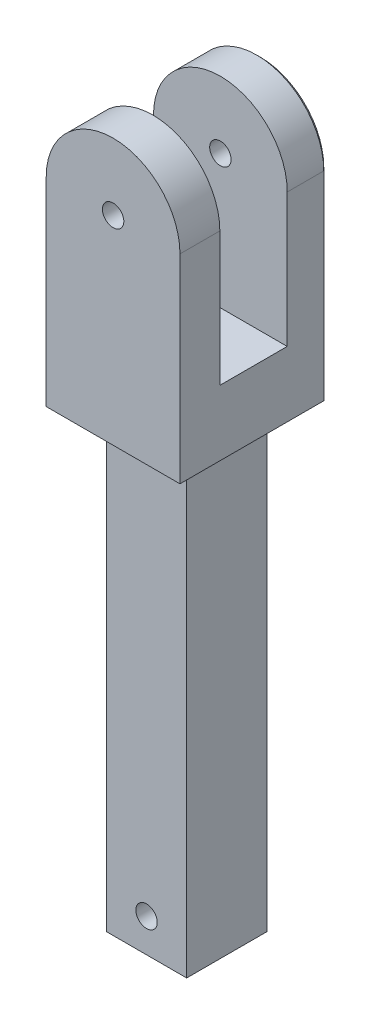
ISO-10303-21;
HEADER;
FILE_DESCRIPTION(('STEP AP214'),'2;1');
FILE_NAME('part.step','',(''),(''),'','','');
FILE_SCHEMA(('AUTOMOTIVE_DESIGN { 1 0 10303 214 1 1 1 1 }'));
ENDSEC;
DATA;
#1=APPLICATION_CONTEXT('core data for automotive mechanical design processes');
#2=APPLICATION_PROTOCOL_DEFINITION('international standard','automotive_design',2000,#1);
#3=PRODUCT_CONTEXT('',#1,'mechanical');
#4=PRODUCT('Part','Part','',(#3));
#5=PRODUCT_RELATED_PRODUCT_CATEGORY('part','',(#4));
#6=PRODUCT_DEFINITION_FORMATION('','',#4);
#7=PRODUCT_DEFINITION_CONTEXT('part definition',#1,'design');
#8=PRODUCT_DEFINITION('design','',#6,#7);
#9=PRODUCT_DEFINITION_SHAPE('','',#8);
#10=(LENGTH_UNIT() NAMED_UNIT(*) SI_UNIT(.MILLI.,.METRE.));
#11=(NAMED_UNIT(*) PLANE_ANGLE_UNIT() SI_UNIT($,.RADIAN.));
#12=(NAMED_UNIT(*) SI_UNIT($,.STERADIAN.) SOLID_ANGLE_UNIT());
#13=UNCERTAINTY_MEASURE_WITH_UNIT(LENGTH_MEASURE(1.E-05),#10,'distance_accuracy_value','');
#14=(GEOMETRIC_REPRESENTATION_CONTEXT(3) GLOBAL_UNCERTAINTY_ASSIGNED_CONTEXT((#13)) GLOBAL_UNIT_ASSIGNED_CONTEXT((#10,
#11,#12)) REPRESENTATION_CONTEXT('',''));
#15=CARTESIAN_POINT('',(0.,0.,0.));
#16=DIRECTION('',(0.,0.,1.));
#17=DIRECTION('',(1.,0.,0.));
#18=AXIS2_PLACEMENT_3D('',#15,#16,#17);
#19=CARTESIAN_POINT('',(10.,0.,12.));
#20=DIRECTION('',(-1.,0.,0.));
#21=DIRECTION('',(0.,-1.,0.));
#22=AXIS2_PLACEMENT_3D('',#19,#20,#21);
#23=PLANE('',#22);
#24=DIRECTION('',(0.,0.,-1.));
#25=VECTOR('',#24,1.);
#26=CARTESIAN_POINT('',(10.,-29.7764175480678,12.));
#27=LINE('',#26,#25);
#28=CARTESIAN_POINT('',(10.,-29.7764175480678,17.));
#29=VERTEX_POINT('',#28);
#30=CARTESIAN_POINT('',(10.,-29.7764175480678,-4.5));
#31=VERTEX_POINT('',#30);
#32=EDGE_CURVE('E58',#29,#31,#27,.T.);
#33=ORIENTED_EDGE('',*,*,#32,.T.);
#34=DIRECTION('',(0.,1.,0.));
#35=VECTOR('',#34,1.);
#36=CARTESIAN_POINT('',(10.,0.,-4.5));
#37=LINE('',#36,#35);
#38=CARTESIAN_POINT('',(10.,0.,-4.5));
#39=VERTEX_POINT('',#38);
#40=EDGE_CURVE('E50',#31,#39,#37,.T.);
#41=ORIENTED_EDGE('',*,*,#40,.T.);
#42=DIRECTION('',(0.,0.,-1.));
#43=VECTOR('',#42,1.);
#44=CARTESIAN_POINT('',(10.,0.,12.));
#45=LINE('',#44,#43);
#46=CARTESIAN_POINT('',(10.,0.,0.959999999999997));
#47=VERTEX_POINT('',#46);
#48=EDGE_CURVE('E244',#47,#39,#45,.T.);
#49=ORIENTED_EDGE('',*,*,#48,.F.);
#50=DIRECTION('',(0.,1.,0.));
#51=VECTOR('',#50,1.);
#52=CARTESIAN_POINT('',(10.,0.,0.959999999999997));
#53=LINE('',#52,#51);
#54=CARTESIAN_POINT('',(10.,-20.,0.959999999999997));
#55=VERTEX_POINT('',#54);
#56=EDGE_CURVE('E201',#55,#47,#53,.T.);
#57=ORIENTED_EDGE('',*,*,#56,.F.);
#58=DIRECTION('',(0.,0.,-1.));
#59=VECTOR('',#58,1.);
#60=CARTESIAN_POINT('',(10.,-20.,0.));
#61=LINE('',#60,#59);
#62=CARTESIAN_POINT('',(10.,-20.,11.04));
#63=VERTEX_POINT('',#62);
#64=EDGE_CURVE('E236',#63,#55,#61,.T.);
#65=ORIENTED_EDGE('',*,*,#64,.F.);
#66=DIRECTION('',(0.,1.,0.));
#67=VECTOR('',#66,1.);
#68=CARTESIAN_POINT('',(10.,0.,11.04));
#69=LINE('',#68,#67);
#70=CARTESIAN_POINT('',(10.,0.,11.04));
#71=VERTEX_POINT('',#70);
#72=EDGE_CURVE('E203',#63,#71,#69,.T.);
#73=ORIENTED_EDGE('',*,*,#72,.T.);
#74=CARTESIAN_POINT('',(10.,0.,17.));
#75=VERTEX_POINT('',#74);
#76=EDGE_CURVE('E245',#75,#71,#45,.T.);
#77=ORIENTED_EDGE('',*,*,#76,.F.);
#78=DIRECTION('',(0.,1.,0.));
#79=VECTOR('',#78,1.);
#80=CARTESIAN_POINT('',(10.,0.,17.));
#81=LINE('',#80,#79);
#82=EDGE_CURVE('E234',#29,#75,#81,.T.);
#83=ORIENTED_EDGE('',*,*,#82,.F.);
#84=EDGE_LOOP('',(#33,#41,#49,#57,#65,#73,#77,#83));
#85=FACE_BOUND('',#84,.T.);
#86=ADVANCED_FACE('F40',(#85),#23,.F.);
#87=CARTESIAN_POINT('',(0.,0.,12.));
#88=DIRECTION('',(0.,0.,-1.));
#89=DIRECTION('',(-1.,0.,0.));
#90=AXIS2_PLACEMENT_3D('',#87,#88,#89);
#91=CYLINDRICAL_SURFACE('',#90,10.);
#92=ORIENTED_EDGE('',*,*,#48,.T.);
#93=CARTESIAN_POINT('',(0.,0.,-4.5));
#94=DIRECTION('',(0.,0.,-1.));
#95=DIRECTION('',(-1.,0.,0.));
#96=AXIS2_PLACEMENT_3D('',#93,#94,#95);
#97=CIRCLE('',#96,10.);
#98=CARTESIAN_POINT('',(-10.,0.,-4.5));
#99=VERTEX_POINT('',#98);
#100=EDGE_CURVE('E277',#39,#99,#97,.F.);
#101=ORIENTED_EDGE('',*,*,#100,.T.);
#102=DIRECTION('',(0.,0.,-1.));
#103=VECTOR('',#102,1.);
#104=CARTESIAN_POINT('',(-10.,0.,12.));
#105=LINE('',#104,#103);
#106=CARTESIAN_POINT('',(-10.,0.,0.959999999999997));
#107=VERTEX_POINT('',#106);
#108=EDGE_CURVE('E239',#107,#99,#105,.T.);
#109=ORIENTED_EDGE('',*,*,#108,.F.);
#110=CARTESIAN_POINT('',(0.,0.,0.959999999999997));
#111=DIRECTION('',(0.,0.,1.));
#112=DIRECTION('',(1.,0.,0.));
#113=AXIS2_PLACEMENT_3D('',#110,#111,#112);
#114=CIRCLE('',#113,10.);
#115=EDGE_CURVE('E221',#47,#107,#114,.T.);
#116=ORIENTED_EDGE('',*,*,#115,.F.);
#117=EDGE_LOOP('',(#92,#101,#109,#116));
#118=FACE_BOUND('',#117,.T.);
#119=ADVANCED_FACE('F329',(#118),#91,.T.);
#120=CARTESIAN_POINT('',(-10.,0.,12.));
#121=DIRECTION('',(1.,0.,0.));
#122=DIRECTION('',(0.,1.,0.));
#123=AXIS2_PLACEMENT_3D('',#120,#121,#122);
#124=PLANE('',#123);
#125=ORIENTED_EDGE('',*,*,#108,.T.);
#126=DIRECTION('',(0.,-1.,0.));
#127=VECTOR('',#126,1.);
#128=CARTESIAN_POINT('',(-10.,-30.2764175480678,-4.5));
#129=LINE('',#128,#127);
#130=CARTESIAN_POINT('',(-10.,-29.7764175480678,-4.5));
#131=VERTEX_POINT('',#130);
#132=EDGE_CURVE('E265',#99,#131,#129,.T.);
#133=ORIENTED_EDGE('',*,*,#132,.T.);
#134=DIRECTION('',(0.,0.,1.));
#135=VECTOR('',#134,1.);
#136=CARTESIAN_POINT('',(-10.,-29.7764175480678,12.));
#137=LINE('',#136,#135);
#138=CARTESIAN_POINT('',(-10.,-29.7764175480678,17.));
#139=VERTEX_POINT('',#138);
#140=EDGE_CURVE('E263',#131,#139,#137,.T.);
#141=ORIENTED_EDGE('',*,*,#140,.T.);
#142=DIRECTION('',(0.,-1.,0.));
#143=VECTOR('',#142,1.);
#144=CARTESIAN_POINT('',(-10.,0.,17.));
#145=LINE('',#144,#143);
#146=CARTESIAN_POINT('',(-10.,0.,17.));
#147=VERTEX_POINT('',#146);
#148=EDGE_CURVE('E232',#147,#139,#145,.T.);
#149=ORIENTED_EDGE('',*,*,#148,.F.);
#150=CARTESIAN_POINT('',(-10.,0.,11.04));
#151=VERTEX_POINT('',#150);
#152=EDGE_CURVE('E241',#147,#151,#105,.T.);
#153=ORIENTED_EDGE('',*,*,#152,.T.);
#154=DIRECTION('',(0.,1.,0.));
#155=VECTOR('',#154,1.);
#156=CARTESIAN_POINT('',(-10.,0.,11.04));
#157=LINE('',#156,#155);
#158=CARTESIAN_POINT('',(-10.,-20.,11.04));
#159=VERTEX_POINT('',#158);
#160=EDGE_CURVE('E204',#159,#151,#157,.T.);
#161=ORIENTED_EDGE('',*,*,#160,.F.);
#162=DIRECTION('',(0.,0.,-1.));
#163=VECTOR('',#162,1.);
#164=CARTESIAN_POINT('',(-10.,-20.,0.));
#165=LINE('',#164,#163);
#166=CARTESIAN_POINT('',(-10.,-20.,0.959999999999997));
#167=VERTEX_POINT('',#166);
#168=EDGE_CURVE('E237',#159,#167,#165,.T.);
#169=ORIENTED_EDGE('',*,*,#168,.T.);
#170=DIRECTION('',(0.,1.,0.));
#171=VECTOR('',#170,1.);
#172=CARTESIAN_POINT('',(-10.,0.,0.959999999999997));
#173=LINE('',#172,#171);
#174=EDGE_CURVE('E166',#167,#107,#173,.T.);
#175=ORIENTED_EDGE('',*,*,#174,.T.);
#176=EDGE_LOOP('',(#125,#133,#141,#149,#153,#161,#169,#175));
#177=FACE_BOUND('',#176,.T.);
#178=ADVANCED_FACE('F334',(#177),#124,.F.);
#179=CARTESIAN_POINT('',(0.,0.,12.));
#180=DIRECTION('',(0.,0.,-1.));
#181=DIRECTION('',(-1.,0.,0.));
#182=AXIS2_PLACEMENT_3D('',#179,#180,#181);
#183=CYLINDRICAL_SURFACE('',#182,1.6);
#184=CARTESIAN_POINT('',(0.,0.,-5.));
#185=DIRECTION('',(0.,0.,-1.));
#186=DIRECTION('',(-1.,0.,0.));
#187=AXIS2_PLACEMENT_3D('',#184,#185,#186);
#188=CIRCLE('',#187,1.6);
#189=CARTESIAN_POINT('',(-1.6,0.,-5.));
#190=VERTEX_POINT('',#189);
#191=EDGE_CURVE('E223',#190,#190,#188,.F.);
#192=ORIENTED_EDGE('',*,*,#191,.F.);
#193=EDGE_LOOP('',(#192));
#194=FACE_BOUND('',#193,.T.);
#195=CARTESIAN_POINT('',(0.,0.,0.959999999999997));
#196=DIRECTION('',(0.,0.,1.));
#197=DIRECTION('',(1.,0.,0.));
#198=AXIS2_PLACEMENT_3D('',#195,#196,#197);
#199=CIRCLE('',#198,1.6);
#200=CARTESIAN_POINT('',(1.6,0.,0.959999999999997));
#201=VERTEX_POINT('',#200);
#202=EDGE_CURVE('E220',#201,#201,#199,.T.);
#203=ORIENTED_EDGE('',*,*,#202,.T.);
#204=EDGE_LOOP('',(#203));
#205=FACE_BOUND('',#204,.T.);
#206=ADVANCED_FACE('F345',(#194,#205),#183,.F.);
#207=ORIENTED_EDGE('',*,*,#76,.T.);
#208=CARTESIAN_POINT('',(0.,0.,11.04));
#209=DIRECTION('',(0.,0.,1.));
#210=DIRECTION('',(1.,0.,0.));
#211=AXIS2_PLACEMENT_3D('',#208,#209,#210);
#212=CIRCLE('',#211,10.);
#213=EDGE_CURVE('E218',#71,#151,#212,.T.);
#214=ORIENTED_EDGE('',*,*,#213,.T.);
#215=ORIENTED_EDGE('',*,*,#152,.F.);
#216=CARTESIAN_POINT('',(0.,0.,17.));
#217=DIRECTION('',(0.,0.,1.));
#218=DIRECTION('',(1.,0.,0.));
#219=AXIS2_PLACEMENT_3D('',#216,#217,#218);
#220=CIRCLE('',#219,10.);
#221=EDGE_CURVE('E229',#75,#147,#220,.T.);
#222=ORIENTED_EDGE('',*,*,#221,.F.);
#223=EDGE_LOOP('',(#207,#214,#215,#222));
#224=FACE_BOUND('',#223,.T.);
#225=ADVANCED_FACE('F337',(#224),#91,.T.);
#226=CARTESIAN_POINT('',(0.,0.,11.04));
#227=DIRECTION('',(0.,0.,1.));
#228=DIRECTION('',(1.,0.,0.));
#229=AXIS2_PLACEMENT_3D('',#226,#227,#228);
#230=CIRCLE('',#229,1.6);
#231=CARTESIAN_POINT('',(1.6,0.,11.04));
#232=VERTEX_POINT('',#231);
#233=EDGE_CURVE('E215',#232,#232,#230,.T.);
#234=ORIENTED_EDGE('',*,*,#233,.F.);
#235=EDGE_LOOP('',(#234));
#236=FACE_BOUND('',#235,.T.);
#237=CARTESIAN_POINT('',(0.,0.,17.));
#238=DIRECTION('',(0.,0.,1.));
#239=DIRECTION('',(1.,0.,0.));
#240=AXIS2_PLACEMENT_3D('',#237,#238,#239);
#241=CIRCLE('',#240,1.6);
#242=CARTESIAN_POINT('',(1.6,0.,17.));
#243=VERTEX_POINT('',#242);
#244=EDGE_CURVE('E226',#243,#243,#241,.F.);
#245=ORIENTED_EDGE('',*,*,#244,.F.);
#246=EDGE_LOOP('',(#245));
#247=FACE_BOUND('',#246,.T.);
#248=ADVANCED_FACE('F340',(#236,#247),#183,.F.);
#249=CARTESIAN_POINT('',(0.,-30.2764175480678,12.));
#250=DIRECTION('',(0.,1.,0.));
#251=DIRECTION('',(0.,0.,1.));
#252=AXIS2_PLACEMENT_3D('',#249,#250,#251);
#253=PLANE('',#252);
#254=DIRECTION('',(0.,0.,-1.));
#255=VECTOR('',#254,1.);
#256=CARTESIAN_POINT('',(-9.5,-30.2764175480678,12.));
#257=LINE('',#256,#255);
#258=CARTESIAN_POINT('',(-9.5,-30.2764175480678,16.5));
#259=VERTEX_POINT('',#258);
#260=CARTESIAN_POINT('',(-9.5,-30.2764175480678,-4.5));
#261=VERTEX_POINT('',#260);
#262=EDGE_CURVE('E272',#259,#261,#257,.T.);
#263=ORIENTED_EDGE('',*,*,#262,.T.);
#264=DIRECTION('',(1.,0.,0.));
#265=VECTOR('',#264,1.);
#266=CARTESIAN_POINT('',(10.,-30.2764175480678,-4.5));
#267=LINE('',#266,#265);
#268=CARTESIAN_POINT('',(9.5,-30.2764175480678,-4.5));
#269=VERTEX_POINT('',#268);
#270=EDGE_CURVE('E274',#261,#269,#267,.T.);
#271=ORIENTED_EDGE('',*,*,#270,.T.);
#272=DIRECTION('',(0.,0.,1.));
#273=VECTOR('',#272,1.);
#274=CARTESIAN_POINT('',(9.5,-30.2764175480678,12.));
#275=LINE('',#274,#273);
#276=CARTESIAN_POINT('',(9.5,-30.2764175480678,16.5));
#277=VERTEX_POINT('',#276);
#278=EDGE_CURVE('E268',#269,#277,#275,.T.);
#279=ORIENTED_EDGE('',*,*,#278,.T.);
#280=DIRECTION('',(-1.,0.,0.));
#281=VECTOR('',#280,1.);
#282=CARTESIAN_POINT('',(-10.,-30.2764175480678,16.5));
#283=LINE('',#282,#281);
#284=EDGE_CURVE('E270',#277,#259,#283,.T.);
#285=ORIENTED_EDGE('',*,*,#284,.T.);
#286=EDGE_LOOP('',(#263,#271,#279,#285));
#287=FACE_BOUND('',#286,.T.);
#288=DIRECTION('',(1.,0.,0.));
#289=VECTOR('',#288,1.);
#290=CARTESIAN_POINT('',(0.,-30.2764175480678,0.));
#291=LINE('',#290,#289);
#292=CARTESIAN_POINT('',(-6.,-30.2764175480678,0.));
#293=VERTEX_POINT('',#292);
#294=CARTESIAN_POINT('',(6.,-30.2764175480678,0.));
#295=VERTEX_POINT('',#294);
#296=EDGE_CURVE('E191',#293,#295,#291,.T.);
#297=ORIENTED_EDGE('',*,*,#296,.F.);
#298=DIRECTION('',(0.,0.,1.));
#299=VECTOR('',#298,1.);
#300=CARTESIAN_POINT('',(-6.,-30.2764175480678,0.));
#301=LINE('',#300,#299);
#302=CARTESIAN_POINT('',(-6.,-30.2764175480678,12.));
#303=VERTEX_POINT('',#302);
#304=EDGE_CURVE('E163',#293,#303,#301,.T.);
#305=ORIENTED_EDGE('',*,*,#304,.T.);
#306=DIRECTION('',(1.,0.,0.));
#307=VECTOR('',#306,1.);
#308=CARTESIAN_POINT('',(0.,-30.2764175480678,12.));
#309=LINE('',#308,#307);
#310=CARTESIAN_POINT('',(6.,-30.2764175480678,12.));
#311=VERTEX_POINT('',#310);
#312=EDGE_CURVE('E180',#303,#311,#309,.T.);
#313=ORIENTED_EDGE('',*,*,#312,.T.);
#314=DIRECTION('',(0.,0.,1.));
#315=VECTOR('',#314,1.);
#316=CARTESIAN_POINT('',(6.,-30.2764175480678,0.));
#317=LINE('',#316,#315);
#318=EDGE_CURVE('E182',#295,#311,#317,.T.);
#319=ORIENTED_EDGE('',*,*,#318,.F.);
#320=EDGE_LOOP('',(#297,#305,#313,#319));
#321=FACE_BOUND('',#320,.T.);
#322=ADVANCED_FACE('F343',(#287,#321),#253,.F.);
#323=CARTESIAN_POINT('',(-10.,-20.,0.));
#324=DIRECTION('',(0.,-1.,0.));
#325=DIRECTION('',(0.,0.,-1.));
#326=AXIS2_PLACEMENT_3D('',#323,#324,#325);
#327=PLANE('',#326);
#328=ORIENTED_EDGE('',*,*,#64,.T.);
#329=DIRECTION('',(-1.,0.,0.));
#330=VECTOR('',#329,1.);
#331=CARTESIAN_POINT('',(10.,-20.,0.959999999999997));
#332=LINE('',#331,#330);
#333=EDGE_CURVE('E207',#55,#167,#332,.T.);
#334=ORIENTED_EDGE('',*,*,#333,.T.);
#335=ORIENTED_EDGE('',*,*,#168,.F.);
#336=DIRECTION('',(-1.,0.,0.));
#337=VECTOR('',#336,1.);
#338=CARTESIAN_POINT('',(10.,-20.,11.04));
#339=LINE('',#338,#337);
#340=EDGE_CURVE('E212',#63,#159,#339,.T.);
#341=ORIENTED_EDGE('',*,*,#340,.F.);
#342=EDGE_LOOP('',(#328,#334,#335,#341));
#343=FACE_BOUND('',#342,.T.);
#344=ADVANCED_FACE('F426',(#343),#327,.F.);
#345=CARTESIAN_POINT('',(0.,0.,17.));
#346=DIRECTION('',(0.,0.,1.));
#347=DIRECTION('',(1.,0.,0.));
#348=AXIS2_PLACEMENT_3D('',#345,#346,#347);
#349=PLANE('',#348);
#350=ORIENTED_EDGE('',*,*,#244,.T.);
#351=EDGE_LOOP('',(#350));
#352=FACE_BOUND('',#351,.T.);
#353=ORIENTED_EDGE('',*,*,#148,.T.);
#354=DIRECTION('',(1.,0.,0.));
#355=VECTOR('',#354,1.);
#356=CARTESIAN_POINT('',(10.,-29.7764175480678,17.));
#357=LINE('',#356,#355);
#358=EDGE_CURVE('E11',#139,#29,#357,.T.);
#359=ORIENTED_EDGE('',*,*,#358,.T.);
#360=ORIENTED_EDGE('',*,*,#82,.T.);
#361=ORIENTED_EDGE('',*,*,#221,.T.);
#362=EDGE_LOOP('',(#353,#359,#360,#361));
#363=FACE_BOUND('',#362,.T.);
#364=ADVANCED_FACE('F434',(#352,#363),#349,.T.);
#365=CARTESIAN_POINT('',(0.,0.,-5.));
#366=DIRECTION('',(0.,0.,-1.));
#367=DIRECTION('',(-1.,0.,0.));
#368=AXIS2_PLACEMENT_3D('',#365,#366,#367);
#369=PLANE('',#368);
#370=DIRECTION('',(-1.,0.,0.));
#371=VECTOR('',#370,1.);
#372=CARTESIAN_POINT('',(-10.,-29.7764175480678,-5.));
#373=LINE('',#372,#371);
#374=CARTESIAN_POINT('',(9.5,-29.7764175480678,-5.));
#375=VERTEX_POINT('',#374);
#376=CARTESIAN_POINT('',(-9.5,-29.7764175480678,-5.));
#377=VERTEX_POINT('',#376);
#378=EDGE_CURVE('E258',#375,#377,#373,.T.);
#379=ORIENTED_EDGE('',*,*,#378,.T.);
#380=DIRECTION('',(0.,1.,0.));
#381=VECTOR('',#380,1.);
#382=CARTESIAN_POINT('',(-9.5,0.,-5.));
#383=LINE('',#382,#381);
#384=CARTESIAN_POINT('',(-9.5,0.,-5.));
#385=VERTEX_POINT('',#384);
#386=EDGE_CURVE('E260',#377,#385,#383,.T.);
#387=ORIENTED_EDGE('',*,*,#386,.T.);
#388=CARTESIAN_POINT('',(0.,0.,-5.));
#389=DIRECTION('',(0.,0.,-1.));
#390=DIRECTION('',(-1.,0.,0.));
#391=AXIS2_PLACEMENT_3D('',#388,#389,#390);
#392=CIRCLE('',#391,9.5);
#393=CARTESIAN_POINT('',(9.5,0.,-5.));
#394=VERTEX_POINT('',#393);
#395=EDGE_CURVE('E256',#385,#394,#392,.T.);
#396=ORIENTED_EDGE('',*,*,#395,.T.);
#397=DIRECTION('',(0.,-1.,0.));
#398=VECTOR('',#397,1.);
#399=CARTESIAN_POINT('',(9.5,-30.2764175480678,-5.));
#400=LINE('',#399,#398);
#401=EDGE_CURVE('E248',#394,#375,#400,.T.);
#402=ORIENTED_EDGE('',*,*,#401,.T.);
#403=EDGE_LOOP('',(#379,#387,#396,#402));
#404=FACE_BOUND('',#403,.T.);
#405=ORIENTED_EDGE('',*,*,#191,.T.);
#406=EDGE_LOOP('',(#405));
#407=FACE_BOUND('',#406,.T.);
#408=ADVANCED_FACE('F445',(#404,#407),#369,.T.);
#409=CARTESIAN_POINT('',(10.,0.,11.04));
#410=DIRECTION('',(0.,0.,1.));
#411=DIRECTION('',(1.,0.,0.));
#412=AXIS2_PLACEMENT_3D('',#409,#410,#411);
#413=PLANE('',#412);
#414=ORIENTED_EDGE('',*,*,#233,.T.);
#415=EDGE_LOOP('',(#414));
#416=FACE_BOUND('',#415,.T.);
#417=ORIENTED_EDGE('',*,*,#72,.F.);
#418=ORIENTED_EDGE('',*,*,#340,.T.);
#419=ORIENTED_EDGE('',*,*,#160,.T.);
#420=ORIENTED_EDGE('',*,*,#213,.F.);
#421=EDGE_LOOP('',(#417,#418,#419,#420));
#422=FACE_BOUND('',#421,.T.);
#423=ADVANCED_FACE('F430',(#416,#422),#413,.F.);
#424=CARTESIAN_POINT('',(10.,0.,0.959999999999997));
#425=DIRECTION('',(0.,0.,1.));
#426=DIRECTION('',(1.,0.,0.));
#427=AXIS2_PLACEMENT_3D('',#424,#425,#426);
#428=PLANE('',#427);
#429=ORIENTED_EDGE('',*,*,#202,.F.);
#430=EDGE_LOOP('',(#429));
#431=FACE_BOUND('',#430,.T.);
#432=ORIENTED_EDGE('',*,*,#115,.T.);
#433=ORIENTED_EDGE('',*,*,#174,.F.);
#434=ORIENTED_EDGE('',*,*,#333,.F.);
#435=ORIENTED_EDGE('',*,*,#56,.T.);
#436=EDGE_LOOP('',(#432,#433,#434,#435));
#437=FACE_BOUND('',#436,.T.);
#438=ADVANCED_FACE('F326',(#431,#437),#428,.T.);
#439=CARTESIAN_POINT('',(-6.,-98.2764175480678,0.));
#440=DIRECTION('',(-1.,0.,0.));
#441=DIRECTION('',(0.,0.,1.));
#442=AXIS2_PLACEMENT_3D('',#439,#440,#441);
#443=PLANE('',#442);
#444=ORIENTED_EDGE('',*,*,#304,.F.);
#445=DIRECTION('',(0.,1.,0.));
#446=VECTOR('',#445,1.);
#447=CARTESIAN_POINT('',(-6.,-98.2764175480678,0.));
#448=LINE('',#447,#446);
#449=CARTESIAN_POINT('',(-6.,-98.2764175480678,0.));
#450=VERTEX_POINT('',#449);
#451=EDGE_CURVE('E156',#450,#293,#448,.T.);
#452=ORIENTED_EDGE('',*,*,#451,.F.);
#453=DIRECTION('',(0.,0.,1.));
#454=VECTOR('',#453,1.);
#455=CARTESIAN_POINT('',(-6.,-98.2764175480678,0.));
#456=LINE('',#455,#454);
#457=CARTESIAN_POINT('',(-6.,-98.2764175480678,12.));
#458=VERTEX_POINT('',#457);
#459=EDGE_CURVE('E161',#450,#458,#456,.T.);
#460=ORIENTED_EDGE('',*,*,#459,.T.);
#461=DIRECTION('',(0.,1.,0.));
#462=VECTOR('',#461,1.);
#463=CARTESIAN_POINT('',(-6.,-98.2764175480678,12.));
#464=LINE('',#463,#462);
#465=EDGE_CURVE('E189',#458,#303,#464,.T.);
#466=ORIENTED_EDGE('',*,*,#465,.T.);
#467=EDGE_LOOP('',(#444,#452,#460,#466));
#468=FACE_BOUND('',#467,.T.);
#469=ADVANCED_FACE('F158',(#468),#443,.T.);
#470=CARTESIAN_POINT('',(0.,-98.2764175480678,0.));
#471=DIRECTION('',(0.,0.,1.));
#472=DIRECTION('',(1.,0.,0.));
#473=AXIS2_PLACEMENT_3D('',#470,#471,#472);
#474=PLANE('',#473);
#475=CARTESIAN_POINT('',(0.,-93.2764175480678,0.));
#476=DIRECTION('',(0.,0.,-1.));
#477=DIRECTION('',(-1.,0.,0.));
#478=AXIS2_PLACEMENT_3D('',#475,#476,#477);
#479=CIRCLE('',#478,1.6);
#480=CARTESIAN_POINT('',(-1.6,-93.2764175480678,0.));
#481=VERTEX_POINT('',#480);
#482=EDGE_CURVE('E185',#481,#481,#479,.T.);
#483=ORIENTED_EDGE('',*,*,#482,.F.);
#484=EDGE_LOOP('',(#483));
#485=FACE_BOUND('',#484,.T.);
#486=ORIENTED_EDGE('',*,*,#296,.T.);
#487=DIRECTION('',(0.,1.,0.));
#488=VECTOR('',#487,1.);
#489=CARTESIAN_POINT('',(6.,-98.2764175480678,0.));
#490=LINE('',#489,#488);
#491=CARTESIAN_POINT('',(6.,-98.2764175480678,0.));
#492=VERTEX_POINT('',#491);
#493=EDGE_CURVE('E167',#492,#295,#490,.T.);
#494=ORIENTED_EDGE('',*,*,#493,.F.);
#495=DIRECTION('',(1.,0.,0.));
#496=VECTOR('',#495,1.);
#497=CARTESIAN_POINT('',(0.,-98.2764175480678,0.));
#498=LINE('',#497,#496);
#499=EDGE_CURVE('E170',#450,#492,#498,.T.);
#500=ORIENTED_EDGE('',*,*,#499,.F.);
#501=ORIENTED_EDGE('',*,*,#451,.T.);
#502=EDGE_LOOP('',(#486,#494,#500,#501));
#503=FACE_BOUND('',#502,.T.);
#504=ADVANCED_FACE('F171',(#485,#503),#474,.F.);
#505=CARTESIAN_POINT('',(6.,-98.2764175480678,0.));
#506=DIRECTION('',(-1.,0.,0.));
#507=DIRECTION('',(0.,0.,1.));
#508=AXIS2_PLACEMENT_3D('',#505,#506,#507);
#509=PLANE('',#508);
#510=ORIENTED_EDGE('',*,*,#318,.T.);
#511=DIRECTION('',(0.,1.,0.));
#512=VECTOR('',#511,1.);
#513=CARTESIAN_POINT('',(6.,-98.2764175480678,12.));
#514=LINE('',#513,#512);
#515=CARTESIAN_POINT('',(6.,-98.2764175480678,12.));
#516=VERTEX_POINT('',#515);
#517=EDGE_CURVE('E197',#516,#311,#514,.T.);
#518=ORIENTED_EDGE('',*,*,#517,.F.);
#519=DIRECTION('',(0.,0.,1.));
#520=VECTOR('',#519,1.);
#521=CARTESIAN_POINT('',(6.,-98.2764175480678,0.));
#522=LINE('',#521,#520);
#523=EDGE_CURVE('E175',#492,#516,#522,.T.);
#524=ORIENTED_EDGE('',*,*,#523,.F.);
#525=ORIENTED_EDGE('',*,*,#493,.T.);
#526=EDGE_LOOP('',(#510,#518,#524,#525));
#527=FACE_BOUND('',#526,.T.);
#528=ADVANCED_FACE('F317',(#527),#509,.F.);
#529=CARTESIAN_POINT('',(0.,-98.2764175480678,12.));
#530=DIRECTION('',(0.,0.,1.));
#531=DIRECTION('',(1.,0.,0.));
#532=AXIS2_PLACEMENT_3D('',#529,#530,#531);
#533=PLANE('',#532);
#534=CARTESIAN_POINT('',(0.,-93.2764175480678,12.));
#535=DIRECTION('',(0.,0.,1.));
#536=DIRECTION('',(1.,0.,0.));
#537=AXIS2_PLACEMENT_3D('',#534,#535,#536);
#538=CIRCLE('',#537,1.6);
#539=CARTESIAN_POINT('',(1.6,-93.2764175480678,12.));
#540=VERTEX_POINT('',#539);
#541=EDGE_CURVE('E192',#540,#540,#538,.T.);
#542=ORIENTED_EDGE('',*,*,#541,.F.);
#543=EDGE_LOOP('',(#542));
#544=FACE_BOUND('',#543,.T.);
#545=ORIENTED_EDGE('',*,*,#312,.F.);
#546=ORIENTED_EDGE('',*,*,#465,.F.);
#547=DIRECTION('',(1.,0.,0.));
#548=VECTOR('',#547,1.);
#549=CARTESIAN_POINT('',(0.,-98.2764175480678,12.));
#550=LINE('',#549,#548);
#551=EDGE_CURVE('E179',#458,#516,#550,.T.);
#552=ORIENTED_EDGE('',*,*,#551,.T.);
#553=ORIENTED_EDGE('',*,*,#517,.T.);
#554=EDGE_LOOP('',(#545,#546,#552,#553));
#555=FACE_BOUND('',#554,.T.);
#556=ADVANCED_FACE('F323',(#544,#555),#533,.T.);
#557=CARTESIAN_POINT('',(0.,-98.2764175480678,0.));
#558=DIRECTION('',(0.,-1.,0.));
#559=DIRECTION('',(0.,0.,-1.));
#560=AXIS2_PLACEMENT_3D('',#557,#558,#559);
#561=PLANE('',#560);
#562=ORIENTED_EDGE('',*,*,#459,.F.);
#563=ORIENTED_EDGE('',*,*,#499,.T.);
#564=ORIENTED_EDGE('',*,*,#523,.T.);
#565=ORIENTED_EDGE('',*,*,#551,.F.);
#566=EDGE_LOOP('',(#562,#563,#564,#565));
#567=FACE_BOUND('',#566,.T.);
#568=ADVANCED_FACE('F177',(#567),#561,.T.);
#569=CARTESIAN_POINT('',(0.,-93.2764175480678,17.));
#570=DIRECTION('',(0.,0.,-1.));
#571=DIRECTION('',(-1.,0.,0.));
#572=AXIS2_PLACEMENT_3D('',#569,#570,#571);
#573=CYLINDRICAL_SURFACE('',#572,1.6);
#574=ORIENTED_EDGE('',*,*,#541,.T.);
#575=EDGE_LOOP('',(#574));
#576=FACE_BOUND('',#575,.T.);
#577=ORIENTED_EDGE('',*,*,#482,.T.);
#578=EDGE_LOOP('',(#577));
#579=FACE_BOUND('',#578,.T.);
#580=ADVANCED_FACE('F314',(#576,#579),#573,.F.);
#581=CARTESIAN_POINT('',(10.,-29.7764175480678,12.));
#582=DIRECTION('',(-0.707106781186547,0.707106781186547,0.));
#583=DIRECTION('',(0.,0.,-1.));
#584=AXIS2_PLACEMENT_3D('',#581,#582,#583);
#585=PLANE('',#584);
#586=DIRECTION('',(0.707106781186547,0.707106781186547,0.));
#587=VECTOR('',#586,1.);
#588=CARTESIAN_POINT('',(9.5,-30.2764175480678,-4.5));
#589=LINE('',#588,#587);
#590=EDGE_CURVE('E301',#31,#269,#589,.F.);
#591=ORIENTED_EDGE('',*,*,#590,.F.);
#592=ORIENTED_EDGE('',*,*,#32,.F.);
#593=DIRECTION('',(0.577350269189626,0.577350269189626,0.577350269189626));
#594=VECTOR('',#593,1.);
#595=CARTESIAN_POINT('',(8.33333333333334,-31.4430842147345,15.3333333333333));
#596=LINE('',#595,#594);
#597=EDGE_CURVE('E45',#277,#29,#596,.T.);
#598=ORIENTED_EDGE('',*,*,#597,.F.);
#599=ORIENTED_EDGE('',*,*,#278,.F.);
#600=EDGE_LOOP('',(#591,#592,#598,#599));
#601=FACE_BOUND('',#600,.T.);
#602=ADVANCED_FACE('F43',(#601),#585,.F.);
#603=CARTESIAN_POINT('',(0.,-29.7764175480678,17.));
#604=DIRECTION('',(0.,-0.707106781186547,0.707106781186547));
#605=DIRECTION('',(-1.,0.,0.));
#606=AXIS2_PLACEMENT_3D('',#603,#604,#605);
#607=PLANE('',#606);
#608=ORIENTED_EDGE('',*,*,#597,.T.);
#609=ORIENTED_EDGE('',*,*,#358,.F.);
#610=DIRECTION('',(-0.577350269189626,0.577350269189626,0.577350269189626));
#611=VECTOR('',#610,1.);
#612=CARTESIAN_POINT('',(-6.66666666666667,-33.1097508814011,13.6666666666667));
#613=LINE('',#612,#611);
#614=EDGE_CURVE('E299',#259,#139,#613,.T.);
#615=ORIENTED_EDGE('',*,*,#614,.F.);
#616=ORIENTED_EDGE('',*,*,#284,.F.);
#617=EDGE_LOOP('',(#608,#609,#615,#616));
#618=FACE_BOUND('',#617,.T.);
#619=ADVANCED_FACE('F394',(#618),#607,.T.);
#620=CARTESIAN_POINT('',(9.5,-30.2764175480678,-4.5));
#621=DIRECTION('',(0.577350269189625,-0.577350269189625,-0.577350269189627));
#622=DIRECTION('',(-0.707106781186548,0.,-0.707106781186547));
#623=AXIS2_PLACEMENT_3D('',#620,#621,#622);
#624=PLANE('',#623);
#625=DIRECTION('',(0.707106781186548,0.,0.707106781186547));
#626=VECTOR('',#625,1.);
#627=CARTESIAN_POINT('',(9.75,-29.7764175480678,-4.75));
#628=LINE('',#627,#626);
#629=EDGE_CURVE('E294',#31,#375,#628,.F.);
#630=ORIENTED_EDGE('',*,*,#629,.F.);
#631=ORIENTED_EDGE('',*,*,#590,.T.);
#632=DIRECTION('',(0.,0.707106781186548,-0.707106781186547));
#633=VECTOR('',#632,1.);
#634=CARTESIAN_POINT('',(9.5,-30.2764175480678,-4.5));
#635=LINE('',#634,#633);
#636=EDGE_CURVE('E297',#375,#269,#635,.F.);
#637=ORIENTED_EDGE('',*,*,#636,.F.);
#638=EDGE_LOOP('',(#630,#631,#637));
#639=FACE_BOUND('',#638,.T.);
#640=ADVANCED_FACE('F388',(#639),#624,.T.);
#641=CARTESIAN_POINT('',(-9.5,-30.2764175480678,12.));
#642=DIRECTION('',(0.707106781186547,0.707106781186547,0.));
#643=DIRECTION('',(0.,0.,-1.));
#644=AXIS2_PLACEMENT_3D('',#641,#642,#643);
#645=PLANE('',#644);
#646=ORIENTED_EDGE('',*,*,#614,.T.);
#647=ORIENTED_EDGE('',*,*,#140,.F.);
#648=DIRECTION('',(0.707106781186547,-0.707106781186547,0.));
#649=VECTOR('',#648,1.);
#650=CARTESIAN_POINT('',(-10.,-29.7764175480678,-4.5));
#651=LINE('',#650,#649);
#652=EDGE_CURVE('E291',#261,#131,#651,.F.);
#653=ORIENTED_EDGE('',*,*,#652,.F.);
#654=ORIENTED_EDGE('',*,*,#262,.F.);
#655=EDGE_LOOP('',(#646,#647,#653,#654));
#656=FACE_BOUND('',#655,.T.);
#657=ADVANCED_FACE('F381',(#656),#645,.F.);
#658=CARTESIAN_POINT('',(0.,-29.7764175480678,-5.));
#659=DIRECTION('',(0.,-0.707106781186547,-0.707106781186548));
#660=DIRECTION('',(1.,0.,0.));
#661=AXIS2_PLACEMENT_3D('',#658,#659,#660);
#662=PLANE('',#661);
#663=ORIENTED_EDGE('',*,*,#636,.T.);
#664=ORIENTED_EDGE('',*,*,#270,.F.);
#665=DIRECTION('',(0.,-0.707106781186548,0.707106781186547));
#666=VECTOR('',#665,1.);
#667=CARTESIAN_POINT('',(-9.5,-30.0264175480678,-4.75));
#668=LINE('',#667,#666);
#669=EDGE_CURVE('E288',#377,#261,#668,.T.);
#670=ORIENTED_EDGE('',*,*,#669,.F.);
#671=ORIENTED_EDGE('',*,*,#378,.F.);
#672=EDGE_LOOP('',(#663,#664,#670,#671));
#673=FACE_BOUND('',#672,.T.);
#674=ADVANCED_FACE('F374',(#673),#662,.T.);
#675=CARTESIAN_POINT('',(9.5,0.,-5.));
#676=DIRECTION('',(0.707106781186547,0.,-0.707106781186548));
#677=DIRECTION('',(0.,1.,0.));
#678=AXIS2_PLACEMENT_3D('',#675,#676,#677);
#679=PLANE('',#678);
#680=ORIENTED_EDGE('',*,*,#629,.T.);
#681=ORIENTED_EDGE('',*,*,#401,.F.);
#682=DIRECTION('',(-0.707106781186548,0.,-0.707106781186547));
#683=VECTOR('',#682,1.);
#684=CARTESIAN_POINT('',(10.,0.,-4.5));
#685=LINE('',#684,#683);
#686=EDGE_CURVE('E285',#39,#394,#685,.T.);
#687=ORIENTED_EDGE('',*,*,#686,.F.);
#688=ORIENTED_EDGE('',*,*,#40,.F.);
#689=EDGE_LOOP('',(#680,#681,#687,#688));
#690=FACE_BOUND('',#689,.T.);
#691=ADVANCED_FACE('F367',(#690),#679,.T.);
#692=CARTESIAN_POINT('',(-10.,-29.7764175480678,-4.5));
#693=DIRECTION('',(-0.577350269189625,-0.577350269189625,-0.577350269189627));
#694=DIRECTION('',(-0.707106781186548,0.,0.707106781186547));
#695=AXIS2_PLACEMENT_3D('',#692,#693,#694);
#696=PLANE('',#695);
#697=ORIENTED_EDGE('',*,*,#669,.T.);
#698=ORIENTED_EDGE('',*,*,#652,.T.);
#699=DIRECTION('',(0.707106781186548,0.,-0.707106781186547));
#700=VECTOR('',#699,1.);
#701=CARTESIAN_POINT('',(-10.,-29.7764175480678,-4.5));
#702=LINE('',#701,#700);
#703=EDGE_CURVE('E283',#377,#131,#702,.F.);
#704=ORIENTED_EDGE('',*,*,#703,.F.);
#705=EDGE_LOOP('',(#697,#698,#704));
#706=FACE_BOUND('',#705,.T.);
#707=ADVANCED_FACE('F360',(#706),#696,.T.);
#708=CARTESIAN_POINT('',(0.,0.,-5.));
#709=DIRECTION('',(0.,0.,1.));
#710=DIRECTION('',(1.,0.,0.));
#711=AXIS2_PLACEMENT_3D('',#708,#709,#710);
#712=CONICAL_SURFACE('',#711,9.5,0.785398163397448);
#713=ORIENTED_EDGE('',*,*,#686,.T.);
#714=ORIENTED_EDGE('',*,*,#395,.F.);
#715=DIRECTION('',(0.707106781186547,0.,-0.707106781186548));
#716=VECTOR('',#715,1.);
#717=CARTESIAN_POINT('',(-10.,0.,-4.5));
#718=LINE('',#717,#716);
#719=EDGE_CURVE('E281',#99,#385,#718,.T.);
#720=ORIENTED_EDGE('',*,*,#719,.F.);
#721=ORIENTED_EDGE('',*,*,#100,.F.);
#722=EDGE_LOOP('',(#713,#714,#720,#721));
#723=FACE_BOUND('',#722,.T.);
#724=ADVANCED_FACE('F353',(#723),#712,.T.);
#725=CARTESIAN_POINT('',(-9.5,0.,-5.));
#726=DIRECTION('',(-0.707106781186547,0.,-0.707106781186548));
#727=DIRECTION('',(0.,-1.,0.));
#728=AXIS2_PLACEMENT_3D('',#725,#726,#727);
#729=PLANE('',#728);
#730=ORIENTED_EDGE('',*,*,#703,.T.);
#731=ORIENTED_EDGE('',*,*,#132,.F.);
#732=ORIENTED_EDGE('',*,*,#719,.T.);
#733=ORIENTED_EDGE('',*,*,#386,.F.);
#734=EDGE_LOOP('',(#730,#731,#732,#733));
#735=FACE_BOUND('',#734,.T.);
#736=ADVANCED_FACE('F347',(#735),#729,.T.);
#737=CLOSED_SHELL('',(#86,#119,#178,#206,#225,#248,#322,#344,#364,#408,#423,#438,#469,#504,#528,
#556,#568,#580,#602,#619,#640,#657,#674,#691,#707,#724,#736));
#738=MANIFOLD_SOLID_BREP('B2',#737);
#739=ADVANCED_BREP_SHAPE_REPRESENTATION('',(#18,#738),#14);
#740=SHAPE_DEFINITION_REPRESENTATION(#9,#739);
ENDSEC;
END-ISO-10303-21;
